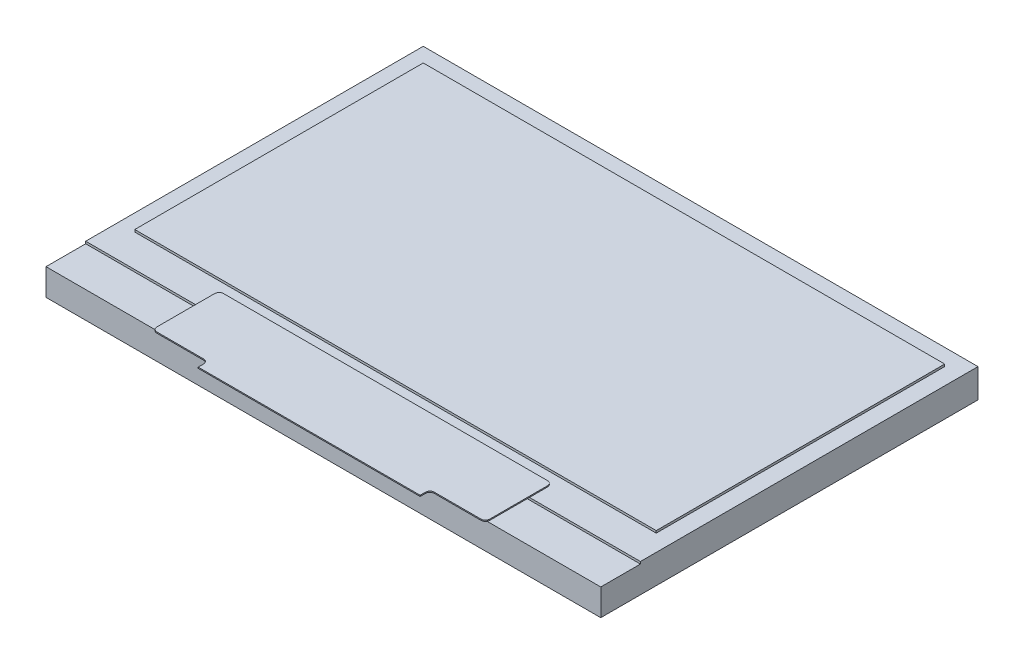
ISO-10303-21;
HEADER;
FILE_DESCRIPTION(('STEP AP214'),'2;1');
FILE_NAME('part.step','',(''),(''),'','','');
FILE_SCHEMA(('AUTOMOTIVE_DESIGN { 1 0 10303 214 1 1 1 1 }'));
ENDSEC;
DATA;
#1=APPLICATION_CONTEXT('core data for automotive mechanical design processes');
#2=APPLICATION_PROTOCOL_DEFINITION('international standard','automotive_design',2000,#1);
#3=PRODUCT_CONTEXT('',#1,'mechanical');
#4=PRODUCT('Part','Part','',(#3));
#5=PRODUCT_RELATED_PRODUCT_CATEGORY('part','',(#4));
#6=PRODUCT_DEFINITION_FORMATION('','',#4);
#7=PRODUCT_DEFINITION_CONTEXT('part definition',#1,'design');
#8=PRODUCT_DEFINITION('design','',#6,#7);
#9=PRODUCT_DEFINITION_SHAPE('','',#8);
#10=(LENGTH_UNIT() NAMED_UNIT(*) SI_UNIT(.MILLI.,.METRE.));
#11=(NAMED_UNIT(*) PLANE_ANGLE_UNIT() SI_UNIT($,.RADIAN.));
#12=(NAMED_UNIT(*) SI_UNIT($,.STERADIAN.) SOLID_ANGLE_UNIT());
#13=UNCERTAINTY_MEASURE_WITH_UNIT(LENGTH_MEASURE(1.E-05),#10,'distance_accuracy_value','');
#14=(GEOMETRIC_REPRESENTATION_CONTEXT(3) GLOBAL_UNCERTAINTY_ASSIGNED_CONTEXT((#13)) GLOBAL_UNIT_ASSIGNED_CONTEXT((#10,
#11,#12)) REPRESENTATION_CONTEXT('',''));
#15=CARTESIAN_POINT('',(0.,0.,0.));
#16=DIRECTION('',(0.,0.,1.));
#17=DIRECTION('',(1.,0.,0.));
#18=AXIS2_PLACEMENT_3D('',#15,#16,#17);
#19=CARTESIAN_POINT('',(0.,1.3,0.));
#20=DIRECTION('',(0.,1.,0.));
#21=DIRECTION('',(0.,0.,1.));
#22=AXIS2_PLACEMENT_3D('',#19,#20,#21);
#23=PLANE('',#22);
#24=DIRECTION('',(-1.,0.,0.));
#25=VECTOR('',#24,1.);
#26=CARTESIAN_POINT('',(11.75,1.3,5.17));
#27=LINE('',#26,#25);
#28=CARTESIAN_POINT('',(11.75,1.3,5.17));
#29=VERTEX_POINT('',#28);
#30=CARTESIAN_POINT('',(-11.75,1.3,5.17));
#31=VERTEX_POINT('',#30);
#32=EDGE_CURVE('E231',#29,#31,#27,.T.);
#33=ORIENTED_EDGE('',*,*,#32,.F.);
#34=DIRECTION('',(0.,0.,-1.));
#35=VECTOR('',#34,1.);
#36=CARTESIAN_POINT('',(11.75,1.3,5.17));
#37=LINE('',#36,#35);
#38=CARTESIAN_POINT('',(11.75,1.3,18.17));
#39=VERTEX_POINT('',#38);
#40=EDGE_CURVE('E228',#39,#29,#37,.T.);
#41=ORIENTED_EDGE('',*,*,#40,.F.);
#42=DIRECTION('',(1.,0.,0.));
#43=VECTOR('',#42,1.);
#44=CARTESIAN_POINT('',(11.75,1.3,18.17));
#45=LINE('',#44,#43);
#46=CARTESIAN_POINT('',(-11.75,1.3,18.17));
#47=VERTEX_POINT('',#46);
#48=EDGE_CURVE('E241',#47,#39,#45,.T.);
#49=ORIENTED_EDGE('',*,*,#48,.F.);
#50=DIRECTION('',(0.,0.,1.));
#51=VECTOR('',#50,1.);
#52=CARTESIAN_POINT('',(-11.75,1.3,5.17));
#53=LINE('',#52,#51);
#54=EDGE_CURVE('E249',#31,#47,#53,.T.);
#55=ORIENTED_EDGE('',*,*,#54,.F.);
#56=EDGE_LOOP('',(#33,#41,#49,#55));
#57=FACE_BOUND('',#56,.T.);
#58=CARTESIAN_POINT('',(7.29999999999998,1.3,18.82));
#59=DIRECTION('',(0.,1.,0.));
#60=DIRECTION('',(0.,0.,-1.));
#61=AXIS2_PLACEMENT_3D('',#58,#59,#60);
#62=CIRCLE('',#61,0.199999999999999);
#63=CARTESIAN_POINT('',(7.49999999999998,1.3,18.82));
#64=VERTEX_POINT('',#63);
#65=CARTESIAN_POINT('',(7.29999999999997,1.3,18.62));
#66=VERTEX_POINT('',#65);
#67=EDGE_CURVE('E337',#64,#66,#62,.T.);
#68=ORIENTED_EDGE('',*,*,#67,.F.);
#69=DIRECTION('',(0.,0.,-1.));
#70=VECTOR('',#69,1.);
#71=CARTESIAN_POINT('',(7.49999999999998,1.3,21.42));
#72=LINE('',#71,#70);
#73=CARTESIAN_POINT('',(7.49999999999998,1.3,19.6327446570302));
#74=VERTEX_POINT('',#73);
#75=EDGE_CURVE('E335',#74,#64,#72,.T.);
#76=ORIENTED_EDGE('',*,*,#75,.F.);
#77=DIRECTION('',(-1.,0.,0.));
#78=VECTOR('',#77,1.);
#79=CARTESIAN_POINT('',(0.,1.3,19.6327446570302));
#80=LINE('',#79,#78);
#81=CARTESIAN_POINT('',(12.5,1.3,19.6327446570302));
#82=VERTEX_POINT('',#81);
#83=EDGE_CURVE('E42',#82,#74,#80,.T.);
#84=ORIENTED_EDGE('',*,*,#83,.F.);
#85=DIRECTION('',(0.,0.,-1.));
#86=VECTOR('',#85,1.);
#87=CARTESIAN_POINT('',(12.5,1.3,4.42));
#88=LINE('',#87,#86);
#89=CARTESIAN_POINT('',(12.5,1.3,4.42));
#90=VERTEX_POINT('',#89);
#91=EDGE_CURVE('E277',#82,#90,#88,.T.);
#92=ORIENTED_EDGE('',*,*,#91,.T.);
#93=DIRECTION('',(-1.,0.,0.));
#94=VECTOR('',#93,1.);
#95=CARTESIAN_POINT('',(-12.5,1.3,4.42));
#96=LINE('',#95,#94);
#97=CARTESIAN_POINT('',(-12.5,1.3,4.42));
#98=VERTEX_POINT('',#97);
#99=EDGE_CURVE('E280',#90,#98,#96,.T.);
#100=ORIENTED_EDGE('',*,*,#99,.T.);
#101=DIRECTION('',(0.,0.,1.));
#102=VECTOR('',#101,1.);
#103=CARTESIAN_POINT('',(-12.5,1.3,4.42));
#104=LINE('',#103,#102);
#105=CARTESIAN_POINT('',(-12.5,1.3,19.6327446570302));
#106=VERTEX_POINT('',#105);
#107=EDGE_CURVE('E274',#98,#106,#104,.T.);
#108=ORIENTED_EDGE('',*,*,#107,.T.);
#109=CARTESIAN_POINT('',(-7.50000000000002,1.3,19.6327446570302));
#110=VERTEX_POINT('',#109);
#111=EDGE_CURVE('E299',#110,#106,#80,.T.);
#112=ORIENTED_EDGE('',*,*,#111,.F.);
#113=DIRECTION('',(0.,0.,1.));
#114=VECTOR('',#113,1.);
#115=CARTESIAN_POINT('',(-7.50000000000002,1.3,21.42));
#116=LINE('',#115,#114);
#117=CARTESIAN_POINT('',(-7.50000000000002,1.3,18.82));
#118=VERTEX_POINT('',#117);
#119=EDGE_CURVE('E49',#118,#110,#116,.T.);
#120=ORIENTED_EDGE('',*,*,#119,.F.);
#121=CARTESIAN_POINT('',(-7.30000000000002,1.3,18.82));
#122=DIRECTION('',(0.,1.,0.));
#123=DIRECTION('',(0.,0.,-1.));
#124=AXIS2_PLACEMENT_3D('',#121,#122,#123);
#125=CIRCLE('',#124,0.2);
#126=CARTESIAN_POINT('',(-7.30000000000002,1.3,18.62));
#127=VERTEX_POINT('',#126);
#128=EDGE_CURVE('E352',#127,#118,#125,.T.);
#129=ORIENTED_EDGE('',*,*,#128,.F.);
#130=DIRECTION('',(-1.,0.,0.));
#131=VECTOR('',#130,1.);
#132=CARTESIAN_POINT('',(-7.30000000000002,1.3,18.62));
#133=LINE('',#132,#131);
#134=EDGE_CURVE('E350',#66,#127,#133,.T.);
#135=ORIENTED_EDGE('',*,*,#134,.F.);
#136=EDGE_LOOP('',(#68,#76,#84,#92,#100,#108,#112,#120,#129,#135));
#137=FACE_BOUND('',#136,.T.);
#138=ADVANCED_FACE('F34',(#57,#137),#23,.T.);
#139=CARTESIAN_POINT('',(-12.5,1.3,4.42));
#140=DIRECTION('',(1.,0.,0.));
#141=DIRECTION('',(0.,0.,-1.));
#142=AXIS2_PLACEMENT_3D('',#139,#140,#141);
#143=PLANE('',#142);
#144=DIRECTION('',(0.,-1.,0.));
#145=VECTOR('',#144,1.);
#146=CARTESIAN_POINT('',(-12.5,1.3,21.42));
#147=LINE('',#146,#145);
#148=CARTESIAN_POINT('',(-12.5,1.2,21.42));
#149=VERTEX_POINT('',#148);
#150=CARTESIAN_POINT('',(-12.5,0.,21.42));
#151=VERTEX_POINT('',#150);
#152=EDGE_CURVE('E298',#149,#151,#147,.T.);
#153=ORIENTED_EDGE('',*,*,#152,.F.);
#154=DIRECTION('',(0.,0.,1.));
#155=VECTOR('',#154,1.);
#156=CARTESIAN_POINT('',(-12.5,1.2,23.68));
#157=LINE('',#156,#155);
#158=CARTESIAN_POINT('',(-12.5,1.2,19.6327446570302));
#159=VERTEX_POINT('',#158);
#160=EDGE_CURVE('E263',#159,#149,#157,.T.);
#161=ORIENTED_EDGE('',*,*,#160,.F.);
#162=DIRECTION('',(0.,-1.,0.));
#163=VECTOR('',#162,1.);
#164=CARTESIAN_POINT('',(-12.5,1.2,19.6327446570302));
#165=LINE('',#164,#163);
#166=EDGE_CURVE('E260',#106,#159,#165,.T.);
#167=ORIENTED_EDGE('',*,*,#166,.F.);
#168=ORIENTED_EDGE('',*,*,#107,.F.);
#169=DIRECTION('',(0.,-1.,0.));
#170=VECTOR('',#169,1.);
#171=CARTESIAN_POINT('',(-12.5,1.3,4.42));
#172=LINE('',#171,#170);
#173=CARTESIAN_POINT('',(-12.5,0.,4.42));
#174=VERTEX_POINT('',#173);
#175=EDGE_CURVE('E282',#98,#174,#172,.T.);
#176=ORIENTED_EDGE('',*,*,#175,.T.);
#177=DIRECTION('',(0.,0.,1.));
#178=VECTOR('',#177,1.);
#179=CARTESIAN_POINT('',(-12.5,0.,4.42));
#180=LINE('',#179,#178);
#181=EDGE_CURVE('E273',#174,#151,#180,.T.);
#182=ORIENTED_EDGE('',*,*,#181,.T.);
#183=EDGE_LOOP('',(#153,#161,#167,#168,#176,#182));
#184=FACE_BOUND('',#183,.T.);
#185=ADVANCED_FACE('F36',(#184),#143,.F.);
#186=CARTESIAN_POINT('',(-12.5,1.3,21.42));
#187=DIRECTION('',(0.,0.,-1.));
#188=DIRECTION('',(-1.,0.,0.));
#189=AXIS2_PLACEMENT_3D('',#186,#187,#188);
#190=PLANE('',#189);
#191=DIRECTION('',(0.,-1.,0.));
#192=VECTOR('',#191,1.);
#193=CARTESIAN_POINT('',(12.5,1.3,21.42));
#194=LINE('',#193,#192);
#195=CARTESIAN_POINT('',(12.5,1.2,21.42));
#196=VERTEX_POINT('',#195);
#197=CARTESIAN_POINT('',(12.5,0.,21.42));
#198=VERTEX_POINT('',#197);
#199=EDGE_CURVE('E296',#196,#198,#194,.T.);
#200=ORIENTED_EDGE('',*,*,#199,.F.);
#201=DIRECTION('',(-1.,0.,0.));
#202=VECTOR('',#201,1.);
#203=CARTESIAN_POINT('',(-12.5,1.2,21.42));
#204=LINE('',#203,#202);
#205=EDGE_CURVE('E270',#196,#149,#204,.T.);
#206=ORIENTED_EDGE('',*,*,#205,.T.);
#207=ORIENTED_EDGE('',*,*,#152,.T.);
#208=DIRECTION('',(1.,0.,0.));
#209=VECTOR('',#208,1.);
#210=CARTESIAN_POINT('',(-12.5,0.,21.42));
#211=LINE('',#210,#209);
#212=EDGE_CURVE('E285',#151,#198,#211,.T.);
#213=ORIENTED_EDGE('',*,*,#212,.T.);
#214=EDGE_LOOP('',(#200,#206,#207,#213));
#215=FACE_BOUND('',#214,.T.);
#216=ADVANCED_FACE('F329',(#215),#190,.F.);
#217=CARTESIAN_POINT('',(12.5,1.3,4.42));
#218=DIRECTION('',(-1.,0.,0.));
#219=DIRECTION('',(0.,0.,1.));
#220=AXIS2_PLACEMENT_3D('',#217,#218,#219);
#221=PLANE('',#220);
#222=DIRECTION('',(0.,-1.,0.));
#223=VECTOR('',#222,1.);
#224=CARTESIAN_POINT('',(12.5,1.3,19.6327446570302));
#225=LINE('',#224,#223);
#226=CARTESIAN_POINT('',(12.5,1.2,19.6327446570302));
#227=VERTEX_POINT('',#226);
#228=EDGE_CURVE('E267',#82,#227,#225,.T.);
#229=ORIENTED_EDGE('',*,*,#228,.T.);
#230=DIRECTION('',(0.,0.,1.));
#231=VECTOR('',#230,1.);
#232=CARTESIAN_POINT('',(12.5,1.2,4.42));
#233=LINE('',#232,#231);
#234=EDGE_CURVE('E11',#227,#196,#233,.T.);
#235=ORIENTED_EDGE('',*,*,#234,.T.);
#236=ORIENTED_EDGE('',*,*,#199,.T.);
#237=DIRECTION('',(0.,0.,-1.));
#238=VECTOR('',#237,1.);
#239=CARTESIAN_POINT('',(12.5,0.,4.42));
#240=LINE('',#239,#238);
#241=CARTESIAN_POINT('',(12.5,0.,4.42));
#242=VERTEX_POINT('',#241);
#243=EDGE_CURVE('E288',#198,#242,#240,.T.);
#244=ORIENTED_EDGE('',*,*,#243,.T.);
#245=DIRECTION('',(0.,-1.,0.));
#246=VECTOR('',#245,1.);
#247=CARTESIAN_POINT('',(12.5,1.3,4.42));
#248=LINE('',#247,#246);
#249=EDGE_CURVE('E293',#90,#242,#248,.T.);
#250=ORIENTED_EDGE('',*,*,#249,.F.);
#251=ORIENTED_EDGE('',*,*,#91,.F.);
#252=EDGE_LOOP('',(#229,#235,#236,#244,#250,#251));
#253=FACE_BOUND('',#252,.T.);
#254=ADVANCED_FACE('F333',(#253),#221,.F.);
#255=CARTESIAN_POINT('',(-12.5,1.3,4.42));
#256=DIRECTION('',(0.,0.,1.));
#257=DIRECTION('',(1.,0.,0.));
#258=AXIS2_PLACEMENT_3D('',#255,#256,#257);
#259=PLANE('',#258);
#260=DIRECTION('',(-1.,0.,0.));
#261=VECTOR('',#260,1.);
#262=CARTESIAN_POINT('',(-12.5,0.,4.42));
#263=LINE('',#262,#261);
#264=EDGE_CURVE('E278',#242,#174,#263,.T.);
#265=ORIENTED_EDGE('',*,*,#264,.T.);
#266=ORIENTED_EDGE('',*,*,#175,.F.);
#267=ORIENTED_EDGE('',*,*,#99,.F.);
#268=ORIENTED_EDGE('',*,*,#249,.T.);
#269=EDGE_LOOP('',(#265,#266,#267,#268));
#270=FACE_BOUND('',#269,.T.);
#271=ADVANCED_FACE('F320',(#270),#259,.F.);
#272=CARTESIAN_POINT('',(0.,0.,0.));
#273=DIRECTION('',(0.,1.,0.));
#274=DIRECTION('',(0.,0.,1.));
#275=AXIS2_PLACEMENT_3D('',#272,#273,#274);
#276=PLANE('',#275);
#277=ORIENTED_EDGE('',*,*,#181,.F.);
#278=ORIENTED_EDGE('',*,*,#264,.F.);
#279=ORIENTED_EDGE('',*,*,#243,.F.);
#280=ORIENTED_EDGE('',*,*,#212,.F.);
#281=EDGE_LOOP('',(#277,#278,#279,#280));
#282=FACE_BOUND('',#281,.T.);
#283=ADVANCED_FACE('F325',(#282),#276,.F.);
#284=CARTESIAN_POINT('',(17.8,1.2,23.68));
#285=DIRECTION('',(0.,-1.,0.));
#286=DIRECTION('',(0.,0.,-1.));
#287=AXIS2_PLACEMENT_3D('',#284,#285,#286);
#288=PLANE('',#287);
#289=ORIENTED_EDGE('',*,*,#234,.F.);
#290=DIRECTION('',(-1.,0.,0.));
#291=VECTOR('',#290,1.);
#292=CARTESIAN_POINT('',(17.8,1.2,19.6327446570302));
#293=LINE('',#292,#291);
#294=EDGE_CURVE('E265',#227,#159,#293,.T.);
#295=ORIENTED_EDGE('',*,*,#294,.T.);
#296=ORIENTED_EDGE('',*,*,#160,.T.);
#297=ORIENTED_EDGE('',*,*,#205,.F.);
#298=EDGE_LOOP('',(#289,#295,#296,#297));
#299=FACE_BOUND('',#298,.T.);
#300=ADVANCED_FACE('F331',(#299),#288,.F.);
#301=CARTESIAN_POINT('',(17.8,1.2,19.6327446570302));
#302=DIRECTION('',(0.,0.,-1.));
#303=DIRECTION('',(-1.,0.,0.));
#304=AXIS2_PLACEMENT_3D('',#301,#302,#303);
#305=PLANE('',#304);
#306=ORIENTED_EDGE('',*,*,#83,.T.);
#307=EDGE_CURVE('E301',#74,#110,#80,.T.);
#308=ORIENTED_EDGE('',*,*,#307,.T.);
#309=ORIENTED_EDGE('',*,*,#111,.T.);
#310=ORIENTED_EDGE('',*,*,#166,.T.);
#311=ORIENTED_EDGE('',*,*,#294,.F.);
#312=ORIENTED_EDGE('',*,*,#228,.F.);
#313=EDGE_LOOP('',(#306,#308,#309,#310,#311,#312));
#314=FACE_BOUND('',#313,.T.);
#315=ADVANCED_FACE('F307',(#314),#305,.F.);
#316=CARTESIAN_POINT('',(11.75,1.4,5.17));
#317=DIRECTION('',(-1.,0.,0.));
#318=DIRECTION('',(0.,0.,1.));
#319=AXIS2_PLACEMENT_3D('',#316,#317,#318);
#320=PLANE('',#319);
#321=ORIENTED_EDGE('',*,*,#40,.T.);
#322=DIRECTION('',(0.,-1.,0.));
#323=VECTOR('',#322,1.);
#324=CARTESIAN_POINT('',(11.75,1.4,5.17));
#325=LINE('',#324,#323);
#326=CARTESIAN_POINT('',(11.75,1.4,5.17));
#327=VERTEX_POINT('',#326);
#328=EDGE_CURVE('E258',#327,#29,#325,.T.);
#329=ORIENTED_EDGE('',*,*,#328,.F.);
#330=DIRECTION('',(0.,0.,-1.));
#331=VECTOR('',#330,1.);
#332=CARTESIAN_POINT('',(11.75,1.4,5.17));
#333=LINE('',#332,#331);
#334=CARTESIAN_POINT('',(11.75,1.4,18.17));
#335=VERTEX_POINT('',#334);
#336=EDGE_CURVE('E237',#335,#327,#333,.T.);
#337=ORIENTED_EDGE('',*,*,#336,.F.);
#338=DIRECTION('',(0.,-1.,0.));
#339=VECTOR('',#338,1.);
#340=CARTESIAN_POINT('',(11.75,1.4,18.17));
#341=LINE('',#340,#339);
#342=EDGE_CURVE('E246',#335,#39,#341,.T.);
#343=ORIENTED_EDGE('',*,*,#342,.T.);
#344=EDGE_LOOP('',(#321,#329,#337,#343));
#345=FACE_BOUND('',#344,.T.);
#346=ADVANCED_FACE('F486',(#345),#320,.F.);
#347=CARTESIAN_POINT('',(11.75,1.4,5.17));
#348=DIRECTION('',(0.,0.,1.));
#349=DIRECTION('',(1.,0.,0.));
#350=AXIS2_PLACEMENT_3D('',#347,#348,#349);
#351=PLANE('',#350);
#352=ORIENTED_EDGE('',*,*,#32,.T.);
#353=DIRECTION('',(0.,-1.,0.));
#354=VECTOR('',#353,1.);
#355=CARTESIAN_POINT('',(-11.75,1.4,5.17));
#356=LINE('',#355,#354);
#357=CARTESIAN_POINT('',(-11.75,1.4,5.17));
#358=VERTEX_POINT('',#357);
#359=EDGE_CURVE('E255',#358,#31,#356,.T.);
#360=ORIENTED_EDGE('',*,*,#359,.F.);
#361=DIRECTION('',(-1.,0.,0.));
#362=VECTOR('',#361,1.);
#363=CARTESIAN_POINT('',(11.75,1.4,5.17));
#364=LINE('',#363,#362);
#365=EDGE_CURVE('E240',#327,#358,#364,.T.);
#366=ORIENTED_EDGE('',*,*,#365,.F.);
#367=ORIENTED_EDGE('',*,*,#328,.T.);
#368=EDGE_LOOP('',(#352,#360,#366,#367));
#369=FACE_BOUND('',#368,.T.);
#370=ADVANCED_FACE('F492',(#369),#351,.F.);
#371=CARTESIAN_POINT('',(-11.75,1.4,5.17));
#372=DIRECTION('',(1.,0.,0.));
#373=DIRECTION('',(0.,0.,-1.));
#374=AXIS2_PLACEMENT_3D('',#371,#372,#373);
#375=PLANE('',#374);
#376=ORIENTED_EDGE('',*,*,#54,.T.);
#377=DIRECTION('',(0.,-1.,0.));
#378=VECTOR('',#377,1.);
#379=CARTESIAN_POINT('',(-11.75,1.4,18.17));
#380=LINE('',#379,#378);
#381=CARTESIAN_POINT('',(-11.75,1.4,18.17));
#382=VERTEX_POINT('',#381);
#383=EDGE_CURVE('E57',#382,#47,#380,.T.);
#384=ORIENTED_EDGE('',*,*,#383,.F.);
#385=DIRECTION('',(0.,0.,1.));
#386=VECTOR('',#385,1.);
#387=CARTESIAN_POINT('',(-11.75,1.4,5.17));
#388=LINE('',#387,#386);
#389=EDGE_CURVE('E243',#358,#382,#388,.T.);
#390=ORIENTED_EDGE('',*,*,#389,.F.);
#391=ORIENTED_EDGE('',*,*,#359,.T.);
#392=EDGE_LOOP('',(#376,#384,#390,#391));
#393=FACE_BOUND('',#392,.T.);
#394=ADVANCED_FACE('F500',(#393),#375,.F.);
#395=CARTESIAN_POINT('',(11.75,1.4,18.17));
#396=DIRECTION('',(0.,0.,-1.));
#397=DIRECTION('',(-1.,0.,0.));
#398=AXIS2_PLACEMENT_3D('',#395,#396,#397);
#399=PLANE('',#398);
#400=ORIENTED_EDGE('',*,*,#48,.T.);
#401=ORIENTED_EDGE('',*,*,#342,.F.);
#402=DIRECTION('',(1.,0.,0.));
#403=VECTOR('',#402,1.);
#404=CARTESIAN_POINT('',(11.75,1.4,18.17));
#405=LINE('',#404,#403);
#406=EDGE_CURVE('E245',#382,#335,#405,.T.);
#407=ORIENTED_EDGE('',*,*,#406,.F.);
#408=ORIENTED_EDGE('',*,*,#383,.T.);
#409=EDGE_LOOP('',(#400,#401,#407,#408));
#410=FACE_BOUND('',#409,.T.);
#411=ADVANCED_FACE('F508',(#410),#399,.F.);
#412=CARTESIAN_POINT('',(0.,1.4,0.));
#413=DIRECTION('',(0.,-1.,0.));
#414=DIRECTION('',(0.,0.,-1.));
#415=AXIS2_PLACEMENT_3D('',#412,#413,#414);
#416=PLANE('',#415);
#417=ORIENTED_EDGE('',*,*,#336,.T.);
#418=ORIENTED_EDGE('',*,*,#365,.T.);
#419=ORIENTED_EDGE('',*,*,#389,.T.);
#420=ORIENTED_EDGE('',*,*,#406,.T.);
#421=EDGE_LOOP('',(#417,#418,#419,#420));
#422=FACE_BOUND('',#421,.T.);
#423=ADVANCED_FACE('F516',(#422),#416,.F.);
#424=CARTESIAN_POINT('',(5.2,1.3,21.82));
#425=DIRECTION('',(0.,-1.,0.));
#426=DIRECTION('',(0.,0.,-1.));
#427=AXIS2_PLACEMENT_3D('',#424,#425,#426);
#428=PLANE('',#427);
#429=ORIENTED_EDGE('',*,*,#307,.F.);
#430=CARTESIAN_POINT('',(7.49999999999998,1.3,21.42));
#431=VERTEX_POINT('',#430);
#432=EDGE_CURVE('E342',#431,#74,#72,.T.);
#433=ORIENTED_EDGE('',*,*,#432,.F.);
#434=CARTESIAN_POINT('',(7.29999999999998,1.3,21.42));
#435=DIRECTION('',(0.,1.,0.));
#436=DIRECTION('',(0.,0.,1.));
#437=AXIS2_PLACEMENT_3D('',#434,#435,#436);
#438=CIRCLE('',#437,0.199999999999999);
#439=CARTESIAN_POINT('',(7.29999999999998,1.3,21.62));
#440=VERTEX_POINT('',#439);
#441=EDGE_CURVE('E343',#440,#431,#438,.T.);
#442=ORIENTED_EDGE('',*,*,#441,.F.);
#443=DIRECTION('',(1.,0.,0.));
#444=VECTOR('',#443,1.);
#445=CARTESIAN_POINT('',(5.2,1.3,21.62));
#446=LINE('',#445,#444);
#447=CARTESIAN_POINT('',(5.2,1.3,21.62));
#448=VERTEX_POINT('',#447);
#449=EDGE_CURVE('E345',#448,#440,#446,.T.);
#450=ORIENTED_EDGE('',*,*,#449,.F.);
#451=CARTESIAN_POINT('',(5.2,1.3,21.82));
#452=DIRECTION('',(0.,-1.,0.));
#453=DIRECTION('',(0.,0.,-1.));
#454=AXIS2_PLACEMENT_3D('',#451,#452,#453);
#455=CIRCLE('',#454,0.199999999999999);
#456=CARTESIAN_POINT('',(5.,1.3,21.82));
#457=VERTEX_POINT('',#456);
#458=EDGE_CURVE('E405',#457,#448,#455,.T.);
#459=ORIENTED_EDGE('',*,*,#458,.F.);
#460=DIRECTION('',(0.,0.,-1.));
#461=VECTOR('',#460,1.);
#462=CARTESIAN_POINT('',(5.,1.3,22.06));
#463=LINE('',#462,#461);
#464=CARTESIAN_POINT('',(5.,1.3,22.06));
#465=VERTEX_POINT('',#464);
#466=EDGE_CURVE('E407',#465,#457,#463,.T.);
#467=ORIENTED_EDGE('',*,*,#466,.F.);
#468=DIRECTION('',(1.,0.,0.));
#469=VECTOR('',#468,1.);
#470=CARTESIAN_POINT('',(-5.,1.3,22.06));
#471=LINE('',#470,#469);
#472=CARTESIAN_POINT('',(-5.,1.3,22.06));
#473=VERTEX_POINT('',#472);
#474=EDGE_CURVE('E227',#473,#465,#471,.T.);
#475=ORIENTED_EDGE('',*,*,#474,.F.);
#476=DIRECTION('',(0.,0.,1.));
#477=VECTOR('',#476,1.);
#478=CARTESIAN_POINT('',(-5.,1.3,21.82));
#479=LINE('',#478,#477);
#480=CARTESIAN_POINT('',(-5.,1.3,21.82));
#481=VERTEX_POINT('',#480);
#482=EDGE_CURVE('E223',#481,#473,#479,.T.);
#483=ORIENTED_EDGE('',*,*,#482,.F.);
#484=CARTESIAN_POINT('',(-5.2,1.3,21.82));
#485=DIRECTION('',(0.,-1.,0.));
#486=DIRECTION('',(0.,0.,1.));
#487=AXIS2_PLACEMENT_3D('',#484,#485,#486);
#488=CIRCLE('',#487,0.199999999999999);
#489=CARTESIAN_POINT('',(-5.2,1.3,21.62));
#490=VERTEX_POINT('',#489);
#491=EDGE_CURVE('E360',#490,#481,#488,.T.);
#492=ORIENTED_EDGE('',*,*,#491,.F.);
#493=DIRECTION('',(1.,0.,0.));
#494=VECTOR('',#493,1.);
#495=CARTESIAN_POINT('',(-7.30000000000002,1.3,21.62));
#496=LINE('',#495,#494);
#497=CARTESIAN_POINT('',(-7.30000000000002,1.3,21.62));
#498=VERTEX_POINT('',#497);
#499=EDGE_CURVE('E358',#498,#490,#496,.T.);
#500=ORIENTED_EDGE('',*,*,#499,.F.);
#501=CARTESIAN_POINT('',(-7.30000000000002,1.3,21.42));
#502=DIRECTION('',(0.,1.,0.));
#503=DIRECTION('',(0.,0.,-1.));
#504=AXIS2_PLACEMENT_3D('',#501,#502,#503);
#505=CIRCLE('',#504,0.199999999999999);
#506=CARTESIAN_POINT('',(-7.50000000000002,1.3,21.42));
#507=VERTEX_POINT('',#506);
#508=EDGE_CURVE('E356',#507,#498,#505,.T.);
#509=ORIENTED_EDGE('',*,*,#508,.F.);
#510=EDGE_CURVE('E354',#110,#507,#116,.T.);
#511=ORIENTED_EDGE('',*,*,#510,.F.);
#512=EDGE_LOOP('',(#429,#433,#442,#450,#459,#467,#475,#483,#492,#500,#509,#511));
#513=FACE_BOUND('',#512,.T.);
#514=ADVANCED_FACE('F404',(#513),#428,.T.);
#515=CARTESIAN_POINT('',(-5.,1.35,22.06));
#516=DIRECTION('',(0.,0.,-1.));
#517=DIRECTION('',(-1.,0.,0.));
#518=AXIS2_PLACEMENT_3D('',#515,#516,#517);
#519=PLANE('',#518);
#520=ORIENTED_EDGE('',*,*,#474,.T.);
#521=DIRECTION('',(0.,-1.,0.));
#522=VECTOR('',#521,1.);
#523=CARTESIAN_POINT('',(5.,1.35,22.06));
#524=LINE('',#523,#522);
#525=CARTESIAN_POINT('',(5.,1.35,22.06));
#526=VERTEX_POINT('',#525);
#527=EDGE_CURVE('E207',#526,#465,#524,.T.);
#528=ORIENTED_EDGE('',*,*,#527,.F.);
#529=DIRECTION('',(1.,0.,0.));
#530=VECTOR('',#529,1.);
#531=CARTESIAN_POINT('',(-5.,1.35,22.06));
#532=LINE('',#531,#530);
#533=CARTESIAN_POINT('',(-5.,1.35,22.06));
#534=VERTEX_POINT('',#533);
#535=EDGE_CURVE('E214',#534,#526,#532,.T.);
#536=ORIENTED_EDGE('',*,*,#535,.F.);
#537=DIRECTION('',(0.,-1.,0.));
#538=VECTOR('',#537,1.);
#539=CARTESIAN_POINT('',(-5.,1.35,22.06));
#540=LINE('',#539,#538);
#541=EDGE_CURVE('E363',#534,#473,#540,.T.);
#542=ORIENTED_EDGE('',*,*,#541,.T.);
#543=EDGE_LOOP('',(#520,#528,#536,#542));
#544=FACE_BOUND('',#543,.T.);
#545=ADVANCED_FACE('F225',(#544),#519,.F.);
#546=CARTESIAN_POINT('',(5.,1.35,22.06));
#547=DIRECTION('',(-1.,0.,0.));
#548=DIRECTION('',(0.,0.,1.));
#549=AXIS2_PLACEMENT_3D('',#546,#547,#548);
#550=PLANE('',#549);
#551=ORIENTED_EDGE('',*,*,#466,.T.);
#552=DIRECTION('',(0.,-1.,0.));
#553=VECTOR('',#552,1.);
#554=CARTESIAN_POINT('',(5.,1.35,21.82));
#555=LINE('',#554,#553);
#556=CARTESIAN_POINT('',(5.,1.35,21.82));
#557=VERTEX_POINT('',#556);
#558=EDGE_CURVE('E210',#557,#457,#555,.T.);
#559=ORIENTED_EDGE('',*,*,#558,.F.);
#560=DIRECTION('',(0.,0.,-1.));
#561=VECTOR('',#560,1.);
#562=CARTESIAN_POINT('',(5.,1.35,22.06));
#563=LINE('',#562,#561);
#564=EDGE_CURVE('E203',#526,#557,#563,.T.);
#565=ORIENTED_EDGE('',*,*,#564,.F.);
#566=ORIENTED_EDGE('',*,*,#527,.T.);
#567=EDGE_LOOP('',(#551,#559,#565,#566));
#568=FACE_BOUND('',#567,.T.);
#569=ADVANCED_FACE('F205',(#568),#550,.F.);
#570=CARTESIAN_POINT('',(5.2,1.35,21.82));
#571=DIRECTION('',(0.,-1.,0.));
#572=DIRECTION('',(0.,0.,-1.));
#573=AXIS2_PLACEMENT_3D('',#570,#571,#572);
#574=CYLINDRICAL_SURFACE('',#573,0.199999999999999);
#575=ORIENTED_EDGE('',*,*,#458,.T.);
#576=DIRECTION('',(0.,-1.,0.));
#577=VECTOR('',#576,1.);
#578=CARTESIAN_POINT('',(5.2,1.35,21.62));
#579=LINE('',#578,#577);
#580=CARTESIAN_POINT('',(5.2,1.35,21.62));
#581=VERTEX_POINT('',#580);
#582=EDGE_CURVE('E233',#581,#448,#579,.T.);
#583=ORIENTED_EDGE('',*,*,#582,.F.);
#584=CARTESIAN_POINT('',(5.2,1.35,21.82));
#585=DIRECTION('',(0.,-1.,0.));
#586=DIRECTION('',(0.,0.,-1.));
#587=AXIS2_PLACEMENT_3D('',#584,#585,#586);
#588=CIRCLE('',#587,0.199999999999999);
#589=EDGE_CURVE('E213',#557,#581,#588,.T.);
#590=ORIENTED_EDGE('',*,*,#589,.F.);
#591=ORIENTED_EDGE('',*,*,#558,.T.);
#592=EDGE_LOOP('',(#575,#583,#590,#591));
#593=FACE_BOUND('',#592,.T.);
#594=ADVANCED_FACE('F432',(#593),#574,.F.);
#595=CARTESIAN_POINT('',(5.2,1.35,21.62));
#596=DIRECTION('',(0.,0.,-1.));
#597=DIRECTION('',(-1.,0.,0.));
#598=AXIS2_PLACEMENT_3D('',#595,#596,#597);
#599=PLANE('',#598);
#600=ORIENTED_EDGE('',*,*,#449,.T.);
#601=DIRECTION('',(0.,-1.,0.));
#602=VECTOR('',#601,1.);
#603=CARTESIAN_POINT('',(7.29999999999998,1.35,21.62));
#604=LINE('',#603,#602);
#605=CARTESIAN_POINT('',(7.29999999999998,1.35,21.62));
#606=VERTEX_POINT('',#605);
#607=EDGE_CURVE('E390',#606,#440,#604,.T.);
#608=ORIENTED_EDGE('',*,*,#607,.F.);
#609=DIRECTION('',(1.,0.,0.));
#610=VECTOR('',#609,1.);
#611=CARTESIAN_POINT('',(5.2,1.35,21.62));
#612=LINE('',#611,#610);
#613=EDGE_CURVE('E399',#581,#606,#612,.T.);
#614=ORIENTED_EDGE('',*,*,#613,.F.);
#615=ORIENTED_EDGE('',*,*,#582,.T.);
#616=EDGE_LOOP('',(#600,#608,#614,#615));
#617=FACE_BOUND('',#616,.T.);
#618=ADVANCED_FACE('F397',(#617),#599,.F.);
#619=CARTESIAN_POINT('',(7.29999999999998,1.35,21.42));
#620=DIRECTION('',(0.,-1.,0.));
#621=DIRECTION('',(0.,0.,-1.));
#622=AXIS2_PLACEMENT_3D('',#619,#620,#621);
#623=CYLINDRICAL_SURFACE('',#622,0.199999999999999);
#624=ORIENTED_EDGE('',*,*,#441,.T.);
#625=DIRECTION('',(0.,-1.,0.));
#626=VECTOR('',#625,1.);
#627=CARTESIAN_POINT('',(7.49999999999998,1.35,21.42));
#628=LINE('',#627,#626);
#629=CARTESIAN_POINT('',(7.49999999999998,1.35,21.42));
#630=VERTEX_POINT('',#629);
#631=EDGE_CURVE('E387',#630,#431,#628,.T.);
#632=ORIENTED_EDGE('',*,*,#631,.F.);
#633=CARTESIAN_POINT('',(7.29999999999998,1.35,21.42));
#634=DIRECTION('',(0.,1.,0.));
#635=DIRECTION('',(0.,0.,1.));
#636=AXIS2_PLACEMENT_3D('',#633,#634,#635);
#637=CIRCLE('',#636,0.199999999999999);
#638=EDGE_CURVE('E429',#606,#630,#637,.T.);
#639=ORIENTED_EDGE('',*,*,#638,.F.);
#640=ORIENTED_EDGE('',*,*,#607,.T.);
#641=EDGE_LOOP('',(#624,#632,#639,#640));
#642=FACE_BOUND('',#641,.T.);
#643=ADVANCED_FACE('F439',(#642),#623,.T.);
#644=CARTESIAN_POINT('',(7.49999999999998,1.35,21.42));
#645=DIRECTION('',(-1.,0.,0.));
#646=DIRECTION('',(0.,0.,1.));
#647=AXIS2_PLACEMENT_3D('',#644,#645,#646);
#648=PLANE('',#647);
#649=ORIENTED_EDGE('',*,*,#432,.T.);
#650=ORIENTED_EDGE('',*,*,#75,.T.);
#651=DIRECTION('',(0.,-1.,0.));
#652=VECTOR('',#651,1.);
#653=CARTESIAN_POINT('',(7.49999999999998,1.35,18.82));
#654=LINE('',#653,#652);
#655=CARTESIAN_POINT('',(7.49999999999998,1.35,18.82));
#656=VERTEX_POINT('',#655);
#657=EDGE_CURVE('E385',#656,#64,#654,.T.);
#658=ORIENTED_EDGE('',*,*,#657,.F.);
#659=DIRECTION('',(0.,0.,-1.));
#660=VECTOR('',#659,1.);
#661=CARTESIAN_POINT('',(7.49999999999998,1.35,21.42));
#662=LINE('',#661,#660);
#663=EDGE_CURVE('E427',#630,#656,#662,.T.);
#664=ORIENTED_EDGE('',*,*,#663,.F.);
#665=ORIENTED_EDGE('',*,*,#631,.T.);
#666=EDGE_LOOP('',(#649,#650,#658,#664,#665));
#667=FACE_BOUND('',#666,.T.);
#668=ADVANCED_FACE('F559',(#667),#648,.F.);
#669=CARTESIAN_POINT('',(7.29999999999998,1.35,18.82));
#670=DIRECTION('',(0.,-1.,0.));
#671=DIRECTION('',(0.,0.,-1.));
#672=AXIS2_PLACEMENT_3D('',#669,#670,#671);
#673=CYLINDRICAL_SURFACE('',#672,0.199999999999999);
#674=ORIENTED_EDGE('',*,*,#67,.T.);
#675=DIRECTION('',(0.,-1.,0.));
#676=VECTOR('',#675,1.);
#677=CARTESIAN_POINT('',(7.29999999999997,1.35,18.62));
#678=LINE('',#677,#676);
#679=CARTESIAN_POINT('',(7.29999999999997,1.35,18.62));
#680=VERTEX_POINT('',#679);
#681=EDGE_CURVE('E382',#680,#66,#678,.T.);
#682=ORIENTED_EDGE('',*,*,#681,.F.);
#683=CARTESIAN_POINT('',(7.29999999999998,1.35,18.82));
#684=DIRECTION('',(0.,1.,0.));
#685=DIRECTION('',(0.,0.,-1.));
#686=AXIS2_PLACEMENT_3D('',#683,#684,#685);
#687=CIRCLE('',#686,0.199999999999999);
#688=EDGE_CURVE('E425',#656,#680,#687,.T.);
#689=ORIENTED_EDGE('',*,*,#688,.F.);
#690=ORIENTED_EDGE('',*,*,#657,.T.);
#691=EDGE_LOOP('',(#674,#682,#689,#690));
#692=FACE_BOUND('',#691,.T.);
#693=ADVANCED_FACE('F569',(#692),#673,.T.);
#694=CARTESIAN_POINT('',(-7.30000000000002,1.35,18.62));
#695=DIRECTION('',(0.,0.,1.));
#696=DIRECTION('',(1.,0.,0.));
#697=AXIS2_PLACEMENT_3D('',#694,#695,#696);
#698=PLANE('',#697);
#699=ORIENTED_EDGE('',*,*,#134,.T.);
#700=DIRECTION('',(0.,-1.,0.));
#701=VECTOR('',#700,1.);
#702=CARTESIAN_POINT('',(-7.30000000000002,1.35,18.62));
#703=LINE('',#702,#701);
#704=CARTESIAN_POINT('',(-7.30000000000002,1.35,18.62));
#705=VERTEX_POINT('',#704);
#706=EDGE_CURVE('E379',#705,#127,#703,.T.);
#707=ORIENTED_EDGE('',*,*,#706,.F.);
#708=DIRECTION('',(-1.,0.,0.));
#709=VECTOR('',#708,1.);
#710=CARTESIAN_POINT('',(-7.30000000000002,1.35,18.62));
#711=LINE('',#710,#709);
#712=EDGE_CURVE('E423',#680,#705,#711,.T.);
#713=ORIENTED_EDGE('',*,*,#712,.F.);
#714=ORIENTED_EDGE('',*,*,#681,.T.);
#715=EDGE_LOOP('',(#699,#707,#713,#714));
#716=FACE_BOUND('',#715,.T.);
#717=ADVANCED_FACE('F578',(#716),#698,.F.);
#718=CARTESIAN_POINT('',(-7.30000000000002,1.35,18.82));
#719=DIRECTION('',(0.,-1.,0.));
#720=DIRECTION('',(0.,0.,-1.));
#721=AXIS2_PLACEMENT_3D('',#718,#719,#720);
#722=CYLINDRICAL_SURFACE('',#721,0.2);
#723=ORIENTED_EDGE('',*,*,#128,.T.);
#724=DIRECTION('',(0.,-1.,0.));
#725=VECTOR('',#724,1.);
#726=CARTESIAN_POINT('',(-7.50000000000002,1.35,18.82));
#727=LINE('',#726,#725);
#728=CARTESIAN_POINT('',(-7.50000000000002,1.35,18.82));
#729=VERTEX_POINT('',#728);
#730=EDGE_CURVE('E377',#729,#118,#727,.T.);
#731=ORIENTED_EDGE('',*,*,#730,.F.);
#732=CARTESIAN_POINT('',(-7.30000000000002,1.35,18.82));
#733=DIRECTION('',(0.,1.,0.));
#734=DIRECTION('',(0.,0.,-1.));
#735=AXIS2_PLACEMENT_3D('',#732,#733,#734);
#736=CIRCLE('',#735,0.2);
#737=EDGE_CURVE('E421',#705,#729,#736,.T.);
#738=ORIENTED_EDGE('',*,*,#737,.F.);
#739=ORIENTED_EDGE('',*,*,#706,.T.);
#740=EDGE_LOOP('',(#723,#731,#738,#739));
#741=FACE_BOUND('',#740,.T.);
#742=ADVANCED_FACE('F588',(#741),#722,.T.);
#743=CARTESIAN_POINT('',(-7.50000000000002,1.35,21.42));
#744=DIRECTION('',(1.,0.,0.));
#745=DIRECTION('',(0.,0.,-1.));
#746=AXIS2_PLACEMENT_3D('',#743,#744,#745);
#747=PLANE('',#746);
#748=ORIENTED_EDGE('',*,*,#119,.T.);
#749=ORIENTED_EDGE('',*,*,#510,.T.);
#750=DIRECTION('',(0.,-1.,0.));
#751=VECTOR('',#750,1.);
#752=CARTESIAN_POINT('',(-7.50000000000002,1.35,21.42));
#753=LINE('',#752,#751);
#754=CARTESIAN_POINT('',(-7.50000000000002,1.35,21.42));
#755=VERTEX_POINT('',#754);
#756=EDGE_CURVE('E374',#755,#507,#753,.T.);
#757=ORIENTED_EDGE('',*,*,#756,.F.);
#758=DIRECTION('',(0.,0.,1.));
#759=VECTOR('',#758,1.);
#760=CARTESIAN_POINT('',(-7.50000000000002,1.35,21.42));
#761=LINE('',#760,#759);
#762=EDGE_CURVE('E419',#729,#755,#761,.T.);
#763=ORIENTED_EDGE('',*,*,#762,.F.);
#764=ORIENTED_EDGE('',*,*,#730,.T.);
#765=EDGE_LOOP('',(#748,#749,#757,#763,#764));
#766=FACE_BOUND('',#765,.T.);
#767=ADVANCED_FACE('F598',(#766),#747,.F.);
#768=CARTESIAN_POINT('',(-7.30000000000002,1.35,21.42));
#769=DIRECTION('',(0.,-1.,0.));
#770=DIRECTION('',(0.,0.,-1.));
#771=AXIS2_PLACEMENT_3D('',#768,#769,#770);
#772=CYLINDRICAL_SURFACE('',#771,0.199999999999999);
#773=ORIENTED_EDGE('',*,*,#508,.T.);
#774=DIRECTION('',(0.,-1.,0.));
#775=VECTOR('',#774,1.);
#776=CARTESIAN_POINT('',(-7.30000000000002,1.35,21.62));
#777=LINE('',#776,#775);
#778=CARTESIAN_POINT('',(-7.30000000000002,1.35,21.62));
#779=VERTEX_POINT('',#778);
#780=EDGE_CURVE('E371',#779,#498,#777,.T.);
#781=ORIENTED_EDGE('',*,*,#780,.F.);
#782=CARTESIAN_POINT('',(-7.30000000000002,1.35,21.42));
#783=DIRECTION('',(0.,1.,0.));
#784=DIRECTION('',(0.,0.,-1.));
#785=AXIS2_PLACEMENT_3D('',#782,#783,#784);
#786=CIRCLE('',#785,0.199999999999999);
#787=EDGE_CURVE('E417',#755,#779,#786,.T.);
#788=ORIENTED_EDGE('',*,*,#787,.F.);
#789=ORIENTED_EDGE('',*,*,#756,.T.);
#790=EDGE_LOOP('',(#773,#781,#788,#789));
#791=FACE_BOUND('',#790,.T.);
#792=ADVANCED_FACE('F608',(#791),#772,.T.);
#793=CARTESIAN_POINT('',(-7.30000000000002,1.35,21.62));
#794=DIRECTION('',(0.,0.,-1.));
#795=DIRECTION('',(-1.,0.,0.));
#796=AXIS2_PLACEMENT_3D('',#793,#794,#795);
#797=PLANE('',#796);
#798=ORIENTED_EDGE('',*,*,#499,.T.);
#799=DIRECTION('',(0.,-1.,0.));
#800=VECTOR('',#799,1.);
#801=CARTESIAN_POINT('',(-5.2,1.35,21.62));
#802=LINE('',#801,#800);
#803=CARTESIAN_POINT('',(-5.2,1.35,21.62));
#804=VERTEX_POINT('',#803);
#805=EDGE_CURVE('E368',#804,#490,#802,.T.);
#806=ORIENTED_EDGE('',*,*,#805,.F.);
#807=DIRECTION('',(1.,0.,0.));
#808=VECTOR('',#807,1.);
#809=CARTESIAN_POINT('',(-7.30000000000002,1.35,21.62));
#810=LINE('',#809,#808);
#811=EDGE_CURVE('E415',#779,#804,#810,.T.);
#812=ORIENTED_EDGE('',*,*,#811,.F.);
#813=ORIENTED_EDGE('',*,*,#780,.T.);
#814=EDGE_LOOP('',(#798,#806,#812,#813));
#815=FACE_BOUND('',#814,.T.);
#816=ADVANCED_FACE('F617',(#815),#797,.F.);
#817=CARTESIAN_POINT('',(-5.2,1.35,21.82));
#818=DIRECTION('',(0.,-1.,0.));
#819=DIRECTION('',(0.,0.,-1.));
#820=AXIS2_PLACEMENT_3D('',#817,#818,#819);
#821=CYLINDRICAL_SURFACE('',#820,0.199999999999999);
#822=ORIENTED_EDGE('',*,*,#491,.T.);
#823=DIRECTION('',(0.,-1.,0.));
#824=VECTOR('',#823,1.);
#825=CARTESIAN_POINT('',(-5.,1.35,21.82));
#826=LINE('',#825,#824);
#827=CARTESIAN_POINT('',(-5.,1.35,21.82));
#828=VERTEX_POINT('',#827);
#829=EDGE_CURVE('E365',#828,#481,#826,.T.);
#830=ORIENTED_EDGE('',*,*,#829,.F.);
#831=CARTESIAN_POINT('',(-5.2,1.35,21.82));
#832=DIRECTION('',(0.,-1.,0.));
#833=DIRECTION('',(0.,0.,1.));
#834=AXIS2_PLACEMENT_3D('',#831,#832,#833);
#835=CIRCLE('',#834,0.199999999999999);
#836=EDGE_CURVE('E413',#804,#828,#835,.T.);
#837=ORIENTED_EDGE('',*,*,#836,.F.);
#838=ORIENTED_EDGE('',*,*,#805,.T.);
#839=EDGE_LOOP('',(#822,#830,#837,#838));
#840=FACE_BOUND('',#839,.T.);
#841=ADVANCED_FACE('F627',(#840),#821,.F.);
#842=CARTESIAN_POINT('',(-5.,1.35,21.82));
#843=DIRECTION('',(1.,0.,0.));
#844=DIRECTION('',(0.,0.,-1.));
#845=AXIS2_PLACEMENT_3D('',#842,#843,#844);
#846=PLANE('',#845);
#847=ORIENTED_EDGE('',*,*,#482,.T.);
#848=ORIENTED_EDGE('',*,*,#541,.F.);
#849=DIRECTION('',(0.,0.,1.));
#850=VECTOR('',#849,1.);
#851=CARTESIAN_POINT('',(-5.,1.35,21.82));
#852=LINE('',#851,#850);
#853=EDGE_CURVE('E219',#828,#534,#852,.T.);
#854=ORIENTED_EDGE('',*,*,#853,.F.);
#855=ORIENTED_EDGE('',*,*,#829,.T.);
#856=EDGE_LOOP('',(#847,#848,#854,#855));
#857=FACE_BOUND('',#856,.T.);
#858=ADVANCED_FACE('F637',(#857),#846,.F.);
#859=CARTESIAN_POINT('',(5.2,1.35,21.82));
#860=DIRECTION('',(0.,-1.,0.));
#861=DIRECTION('',(0.,0.,-1.));
#862=AXIS2_PLACEMENT_3D('',#859,#860,#861);
#863=PLANE('',#862);
#864=ORIENTED_EDGE('',*,*,#535,.T.);
#865=ORIENTED_EDGE('',*,*,#564,.T.);
#866=ORIENTED_EDGE('',*,*,#589,.T.);
#867=ORIENTED_EDGE('',*,*,#613,.T.);
#868=ORIENTED_EDGE('',*,*,#638,.T.);
#869=ORIENTED_EDGE('',*,*,#663,.T.);
#870=ORIENTED_EDGE('',*,*,#688,.T.);
#871=ORIENTED_EDGE('',*,*,#712,.T.);
#872=ORIENTED_EDGE('',*,*,#737,.T.);
#873=ORIENTED_EDGE('',*,*,#762,.T.);
#874=ORIENTED_EDGE('',*,*,#787,.T.);
#875=ORIENTED_EDGE('',*,*,#811,.T.);
#876=ORIENTED_EDGE('',*,*,#836,.T.);
#877=ORIENTED_EDGE('',*,*,#853,.T.);
#878=EDGE_LOOP('',(#864,#865,#866,#867,#868,#869,#870,#871,#872,#873,#874,#875,#876,#877));
#879=FACE_BOUND('',#878,.T.);
#880=ADVANCED_FACE('F217',(#879),#863,.F.);
#881=CLOSED_SHELL('',(#138,#185,#216,#254,#271,#283,#300,#315,#346,#370,#394,#411,#423,#514,
#545,#569,#594,#618,#643,#668,#693,#717,#742,#767,#792,#816,#841,#858,#880));
#882=MANIFOLD_SOLID_BREP('B2',#881);
#883=ADVANCED_BREP_SHAPE_REPRESENTATION('',(#18,#882),#14);
#884=SHAPE_DEFINITION_REPRESENTATION(#9,#883);
ENDSEC;
END-ISO-10303-21;
